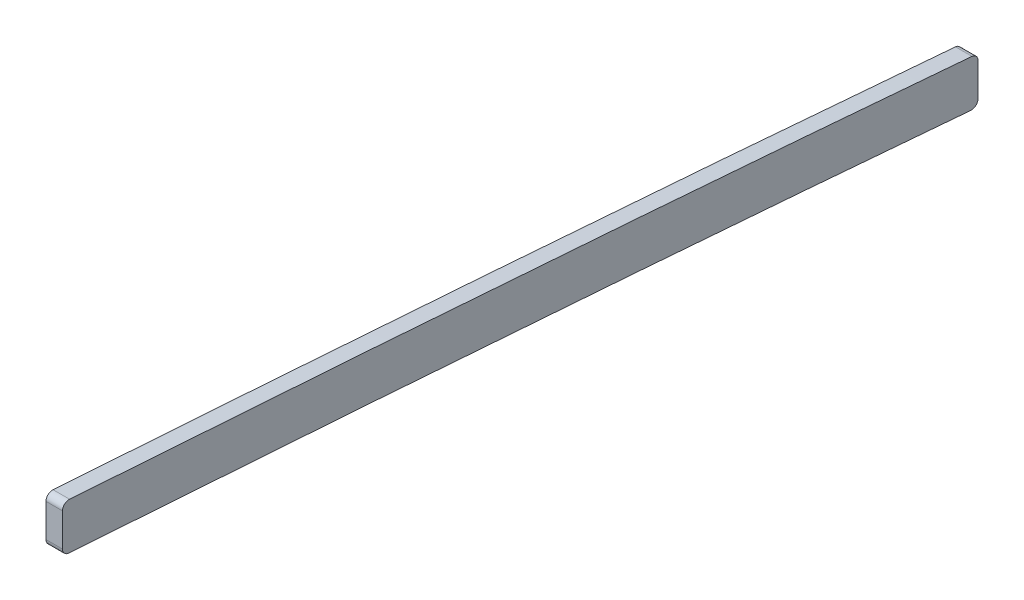
ISO-10303-21;
HEADER;
FILE_DESCRIPTION(('STEP AP214'),'2;1');
FILE_NAME('part.step','',(''),(''),'','','');
FILE_SCHEMA(('AUTOMOTIVE_DESIGN { 1 0 10303 214 1 1 1 1 }'));
ENDSEC;
DATA;
#1=APPLICATION_CONTEXT('core data for automotive mechanical design processes');
#2=APPLICATION_PROTOCOL_DEFINITION('international standard','automotive_design',2000,#1);
#3=PRODUCT_CONTEXT('',#1,'mechanical');
#4=PRODUCT('Part','Part','',(#3));
#5=PRODUCT_RELATED_PRODUCT_CATEGORY('part','',(#4));
#6=PRODUCT_DEFINITION_FORMATION('','',#4);
#7=PRODUCT_DEFINITION_CONTEXT('part definition',#1,'design');
#8=PRODUCT_DEFINITION('design','',#6,#7);
#9=PRODUCT_DEFINITION_SHAPE('','',#8);
#10=(LENGTH_UNIT() NAMED_UNIT(*) SI_UNIT(.MILLI.,.METRE.));
#11=(NAMED_UNIT(*) PLANE_ANGLE_UNIT() SI_UNIT($,.RADIAN.));
#12=(NAMED_UNIT(*) SI_UNIT($,.STERADIAN.) SOLID_ANGLE_UNIT());
#13=UNCERTAINTY_MEASURE_WITH_UNIT(LENGTH_MEASURE(1.E-05),#10,'distance_accuracy_value','');
#14=(GEOMETRIC_REPRESENTATION_CONTEXT(3) GLOBAL_UNCERTAINTY_ASSIGNED_CONTEXT((#13)) GLOBAL_UNIT_ASSIGNED_CONTEXT((#10,
#11,#12)) REPRESENTATION_CONTEXT('',''));
#15=CARTESIAN_POINT('',(0.,0.,0.));
#16=DIRECTION('',(0.,0.,1.));
#17=DIRECTION('',(1.,0.,0.));
#18=AXIS2_PLACEMENT_3D('',#15,#16,#17);
#19=CARTESIAN_POINT('',(1.5875,0.,0.));
#20=DIRECTION('',(1.,0.,0.));
#21=DIRECTION('',(0.,0.,-1.));
#22=AXIS2_PLACEMENT_3D('',#19,#20,#21);
#23=PLANE('',#22);
#24=CARTESIAN_POINT('',(1.5875,114.744712211049,-1735.36978708818));
#25=CARTESIAN_POINT('',(1.5875,110.735232017816,-1815.99594072318));
#26=CARTESIAN_POINT('',(1.5875,104.09636454831,-1936.9066504622));
#27=CARTESIAN_POINT('',(1.5875,94.1879787504419,-2098.04948516813));
#28=CARTESIAN_POINT('',(1.5875,87.3146385091305,-2198.69473672509));
#29=CARTESIAN_POINT('',(1.5875,81.1144189306114,-2279.13041374665));
#30=CARTESIAN_POINT('',(1.5875,76.0340766078011,-2339.41295030379));
#31=CARTESIAN_POINT('',(1.5875,70.2827054495217,-2399.56405433432));
#32=CARTESIAN_POINT('',(1.5875,61.1273782537238,-2479.57046826411));
#33=CARTESIAN_POINT('',(1.5875,49.6509076137669,-2559.29208787163));
#34=CARTESIAN_POINT('',(1.5875,38.2354847347183,-2626.79755458493));
#35=CARTESIAN_POINT('',(1.5875,32.3571302958871,-2659.27265183733));
#36=CARTESIAN_POINT('',(1.5875,28.6522110138429,-2679.06248770776));
#37=CARTESIAN_POINT('',(1.5875,26.3541994456866,-2690.94044026322));
#38=CARTESIAN_POINT('',(1.5875,24.9439248982718,-2698.06642332353));
#39=B_SPLINE_CURVE_WITH_KNOTS('',3,(#24,#25,#26,#27,#28,#29,#30,#31,#32,#33,#34,#35,#36,#37,
#38),.UNSPECIFIED.,.F.,.F.,(4,1,1,1,1,1,1,1,1,1,1,1,4),(0.,0.25,0.375,0.5,0.5625,0.625,0.6875,
0.75,0.875,0.9375,0.962410670199827,0.977446402119896,1.),.UNSPECIFIED.);
#40=CARTESIAN_POINT('',(1.5875,91.519678648898,-2136.37222712257));
#41=VERTEX_POINT('',#40);
#42=CARTESIAN_POINT('',(1.5875,78.4872851145334,-2310.02255532039));
#43=VERTEX_POINT('',#42);
#44=EDGE_CURVE('E115',#41,#43,#39,.T.);
#45=ORIENTED_EDGE('',*,*,#44,.T.);
#46=CARTESIAN_POINT('',(1.5875,79.752731929229,-2310.13));
#47=DIRECTION('',(1.,0.,0.));
#48=DIRECTION('',(0.,0.,-1.));
#49=AXIS2_PLACEMENT_3D('',#46,#47,#48);
#50=CIRCLE('',#49,1.27);
#51=CARTESIAN_POINT('',(1.5875,79.7527319292289,-2311.4));
#52=VERTEX_POINT('',#51);
#53=EDGE_CURVE('E247',#43,#52,#50,.T.);
#54=ORIENTED_EDGE('',*,*,#53,.T.);
#55=DIRECTION('',(0.,1.,0.));
#56=VECTOR('',#55,1.);
#57=CARTESIAN_POINT('',(1.5875,-1.15096295574831E-10,-2311.4));
#58=LINE('',#57,#56);
#59=CARTESIAN_POINT('',(1.5875,86.121800307132,-2311.4));
#60=VERTEX_POINT('',#59);
#61=EDGE_CURVE('E260',#52,#60,#58,.T.);
#62=ORIENTED_EDGE('',*,*,#61,.T.);
#63=CARTESIAN_POINT('',(1.5875,86.121800307132,-2310.13));
#64=DIRECTION('',(1.,0.,0.));
#65=DIRECTION('',(0.,0.,-1.));
#66=AXIS2_PLACEMENT_3D('',#63,#64,#65);
#67=CIRCLE('',#66,1.27);
#68=CARTESIAN_POINT('',(1.5875,87.3873581201983,-2310.23736802677));
#69=VERTEX_POINT('',#68);
#70=EDGE_CURVE('E168',#60,#69,#67,.T.);
#71=ORIENTED_EDGE('',*,*,#70,.T.);
#72=CARTESIAN_POINT('',(1.5875,100.417177393438,-2136.54276318493));
#73=CARTESIAN_POINT('',(1.5875,98.5571137716093,-2164.1860073924));
#74=CARTESIAN_POINT('',(1.5875,96.6188952190012,-2191.82395619038));
#75=CARTESIAN_POINT('',(1.5875,93.0801686873999,-2239.58699871448));
#76=CARTESIAN_POINT('',(1.5875,91.5298376215323,-2259.71628097743));
#77=CARTESIAN_POINT('',(1.5875,89.0908434299724,-2289.90044260235));
#78=CARTESIAN_POINT('',(1.5875,88.2588450388707,-2299.96017913521));
#79=CARTESIAN_POINT('',(1.5875,87.3996547943512,-2310.09118107085));
#80=CARTESIAN_POINT('',(1.5875,87.3934551380196,-2310.16427019507));
#81=CARTESIAN_POINT('',(1.5875,87.387254374734,-2310.23735922312));
#82=B_SPLINE_CURVE_WITH_KNOTS('',3,(#72,#73,#74,#75,#76,#77,#78,#79,#80,#81),.UNSPECIFIED.,.F.,
.F.,(4,2,2,2,4),(0.414227985667118,0.5,0.5625,0.59375,0.593977088680723),.UNSPECIFIED.);
#83=CARTESIAN_POINT('',(1.5875,100.41717746977,-2136.54276319007));
#84=VERTEX_POINT('',#83);
#85=EDGE_CURVE('E127',#84,#69,#82,.T.);
#86=ORIENTED_EDGE('',*,*,#85,.F.);
#87=CARTESIAN_POINT('',(1.5875,99.1500427560389,-2136.4575));
#88=DIRECTION('',(1.,0.,0.));
#89=DIRECTION('',(0.,0.,-1.));
#90=AXIS2_PLACEMENT_3D('',#87,#88,#89);
#91=CIRCLE('',#90,1.27);
#92=CARTESIAN_POINT('',(1.5875,99.1500427560389,-2135.1875));
#93=VERTEX_POINT('',#92);
#94=EDGE_CURVE('E160',#84,#93,#91,.T.);
#95=ORIENTED_EDGE('',*,*,#94,.T.);
#96=DIRECTION('',(0.,-1.,0.));
#97=VECTOR('',#96,1.);
#98=CARTESIAN_POINT('',(1.5875,0.,-2135.1875));
#99=LINE('',#98,#97);
#100=CARTESIAN_POINT('',(1.5875,92.7868126340687,-2135.1875));
#101=VERTEX_POINT('',#100);
#102=EDGE_CURVE('E155',#93,#101,#99,.T.);
#103=ORIENTED_EDGE('',*,*,#102,.T.);
#104=CARTESIAN_POINT('',(1.5875,92.7868126340687,-2136.4575));
#105=DIRECTION('',(1.,0.,0.));
#106=DIRECTION('',(0.,0.,-1.));
#107=AXIS2_PLACEMENT_3D('',#104,#105,#106);
#108=CIRCLE('',#107,1.27);
#109=EDGE_CURVE('E253',#101,#41,#108,.T.);
#110=ORIENTED_EDGE('',*,*,#109,.T.);
#111=EDGE_LOOP('',(#45,#54,#62,#71,#86,#95,#103,#110));
#112=FACE_BOUND('',#111,.T.);
#113=ADVANCED_FACE('F40',(#112),#23,.T.);
#114=CARTESIAN_POINT('',(-1.5875,0.,0.));
#115=DIRECTION('',(1.,0.,0.));
#116=DIRECTION('',(0.,0.,-1.));
#117=AXIS2_PLACEMENT_3D('',#114,#115,#116);
#118=PLANE('',#117);
#119=DIRECTION('',(0.,1.,0.));
#120=VECTOR('',#119,1.);
#121=CARTESIAN_POINT('',(-1.5875,-1.15096295574831E-10,-2311.4));
#122=LINE('',#121,#120);
#123=CARTESIAN_POINT('',(-1.5875,79.7527319292289,-2311.4));
#124=VERTEX_POINT('',#123);
#125=CARTESIAN_POINT('',(-1.5875,86.121800307132,-2311.4));
#126=VERTEX_POINT('',#125);
#127=EDGE_CURVE('E157',#124,#126,#122,.T.);
#128=ORIENTED_EDGE('',*,*,#127,.F.);
#129=CARTESIAN_POINT('',(-1.5875,79.752731929229,-2310.13));
#130=DIRECTION('',(1.,0.,0.));
#131=DIRECTION('',(0.,0.,-1.));
#132=AXIS2_PLACEMENT_3D('',#129,#130,#131);
#133=CIRCLE('',#132,1.27);
#134=CARTESIAN_POINT('',(-1.5875,78.4872851145334,-2310.02255532039));
#135=VERTEX_POINT('',#134);
#136=EDGE_CURVE('E126',#124,#135,#133,.F.);
#137=ORIENTED_EDGE('',*,*,#136,.T.);
#138=CARTESIAN_POINT('',(-1.5875,114.744712211049,-1735.36978708818));
#139=CARTESIAN_POINT('',(-1.5875,110.735232017816,-1815.99594072318));
#140=CARTESIAN_POINT('',(-1.5875,104.09636454831,-1936.9066504622));
#141=CARTESIAN_POINT('',(-1.5875,94.1879787504419,-2098.04948516813));
#142=CARTESIAN_POINT('',(-1.5875,87.3146385091305,-2198.69473672509));
#143=CARTESIAN_POINT('',(-1.5875,81.1144189306114,-2279.13041374665));
#144=CARTESIAN_POINT('',(-1.5875,76.0340766078011,-2339.41295030379));
#145=CARTESIAN_POINT('',(-1.5875,70.2827054495217,-2399.56405433432));
#146=CARTESIAN_POINT('',(-1.5875,61.1273782537238,-2479.57046826411));
#147=CARTESIAN_POINT('',(-1.5875,49.6509076137669,-2559.29208787163));
#148=CARTESIAN_POINT('',(-1.5875,38.2354847347183,-2626.79755458493));
#149=CARTESIAN_POINT('',(-1.5875,32.3571302958871,-2659.27265183733));
#150=CARTESIAN_POINT('',(-1.5875,28.6522110138429,-2679.06248770776));
#151=CARTESIAN_POINT('',(-1.5875,26.3541994456866,-2690.94044026322));
#152=CARTESIAN_POINT('',(-1.5875,24.9439248982718,-2698.06642332353));
#153=B_SPLINE_CURVE_WITH_KNOTS('',3,(#138,#139,#140,#141,#142,#143,#144,#145,#146,#147,#148,
#149,#150,#151,#152),.UNSPECIFIED.,.F.,.F.,(4,1,1,1,1,1,1,1,1,1,1,1,4),(0.,0.25,0.375,0.5,
0.5625,0.625,0.6875,0.75,0.875,0.9375,0.962410670199827,0.977446402119896,1.),.UNSPECIFIED.);
#154=CARTESIAN_POINT('',(-1.5875,91.519678648898,-2136.37222712257));
#155=VERTEX_POINT('',#154);
#156=EDGE_CURVE('E112',#155,#135,#153,.T.);
#157=ORIENTED_EDGE('',*,*,#156,.F.);
#158=CARTESIAN_POINT('',(-1.5875,92.7868126340687,-2136.4575));
#159=DIRECTION('',(1.,0.,0.));
#160=DIRECTION('',(0.,0.,-1.));
#161=AXIS2_PLACEMENT_3D('',#158,#159,#160);
#162=CIRCLE('',#161,1.27);
#163=CARTESIAN_POINT('',(-1.5875,92.7868126340687,-2135.1875));
#164=VERTEX_POINT('',#163);
#165=EDGE_CURVE('E123',#155,#164,#162,.F.);
#166=ORIENTED_EDGE('',*,*,#165,.T.);
#167=DIRECTION('',(0.,-1.,0.));
#168=VECTOR('',#167,1.);
#169=CARTESIAN_POINT('',(-1.5875,0.,-2135.1875));
#170=LINE('',#169,#168);
#171=CARTESIAN_POINT('',(-1.5875,99.1500427560389,-2135.1875));
#172=VERTEX_POINT('',#171);
#173=EDGE_CURVE('E119',#172,#164,#170,.T.);
#174=ORIENTED_EDGE('',*,*,#173,.F.);
#175=CARTESIAN_POINT('',(-1.5875,99.1500427560389,-2136.4575));
#176=DIRECTION('',(1.,0.,0.));
#177=DIRECTION('',(0.,0.,-1.));
#178=AXIS2_PLACEMENT_3D('',#175,#176,#177);
#179=CIRCLE('',#178,1.27);
#180=CARTESIAN_POINT('',(-1.5875,100.417176047924,-2136.54276309439));
#181=VERTEX_POINT('',#180);
#182=EDGE_CURVE('E62',#172,#181,#179,.F.);
#183=ORIENTED_EDGE('',*,*,#182,.T.);
#184=CARTESIAN_POINT('',(-1.5875,87.387254374394,-2310.23735922713));
#185=CARTESIAN_POINT('',(-1.5875,87.3934551377931,-2310.16427019774));
#186=CARTESIAN_POINT('',(-1.5875,87.399654794238,-2310.09118107218));
#187=CARTESIAN_POINT('',(-1.5875,88.2588450388707,-2299.96017913521));
#188=CARTESIAN_POINT('',(-1.5875,89.0908434299724,-2289.90044260235));
#189=CARTESIAN_POINT('',(-1.5875,91.5298376215323,-2259.71628097743));
#190=CARTESIAN_POINT('',(-1.5875,93.0801686873999,-2239.58699871448));
#191=CARTESIAN_POINT('',(-1.5875,96.6188952190014,-2191.82395619037));
#192=CARTESIAN_POINT('',(-1.5875,98.5571137716097,-2164.18600739239));
#193=CARTESIAN_POINT('',(-1.5875,100.417177393438,-2136.54276318492));
#194=B_SPLINE_CURVE_WITH_KNOTS('',3,(#184,#185,#186,#187,#188,#189,#190,#191,#192,#193),
.UNSPECIFIED.,.F.,.F.,(4,2,2,2,4),(0.414227985667109,0.414455074351982,0.445705074351982,
0.508205074351982,0.593977088684873),.UNSPECIFIED.);
#195=CARTESIAN_POINT('',(-1.5875,87.3873576545853,-2310.23736798927));
#196=VERTEX_POINT('',#195);
#197=EDGE_CURVE('E128',#181,#196,#194,.F.);
#198=ORIENTED_EDGE('',*,*,#197,.T.);
#199=CARTESIAN_POINT('',(-1.5875,86.121800307132,-2310.13));
#200=DIRECTION('',(1.,0.,0.));
#201=DIRECTION('',(0.,0.,-1.));
#202=AXIS2_PLACEMENT_3D('',#199,#200,#201);
#203=CIRCLE('',#202,1.27);
#204=EDGE_CURVE('E132',#196,#126,#203,.F.);
#205=ORIENTED_EDGE('',*,*,#204,.T.);
#206=EDGE_LOOP('',(#128,#137,#157,#166,#174,#183,#198,#205));
#207=FACE_BOUND('',#206,.T.);
#208=ADVANCED_FACE('F122',(#207),#118,.F.);
#209=DIRECTION('',(1.,0.,0.));
#210=VECTOR('',#209,1.);
#211=SURFACE_OF_LINEAR_EXTRUSION('',#153,#210);
#212=ORIENTED_EDGE('',*,*,#156,.T.);
#213=DIRECTION('',(1.,0.,0.));
#214=VECTOR('',#213,1.);
#215=CARTESIAN_POINT('',(-1.5875,78.4872851145334,-2310.02255532039));
#216=LINE('',#215,#214);
#217=EDGE_CURVE('E118',#135,#43,#216,.T.);
#218=ORIENTED_EDGE('',*,*,#217,.T.);
#219=ORIENTED_EDGE('',*,*,#44,.F.);
#220=DIRECTION('',(1.,0.,0.));
#221=VECTOR('',#220,1.);
#222=CARTESIAN_POINT('',(1.5875,91.519678648898,-2136.37222712257));
#223=LINE('',#222,#221);
#224=EDGE_CURVE('E108',#41,#155,#223,.F.);
#225=ORIENTED_EDGE('',*,*,#224,.T.);
#226=EDGE_LOOP('',(#212,#218,#219,#225));
#227=FACE_BOUND('',#226,.T.);
#228=ADVANCED_FACE('F110',(#227),#211,.T.);
#229=CARTESIAN_POINT('',(-1.5875,123.62374006878,-1735.81133470922));
#230=CARTESIAN_POINT('',(-1.5875,121.618292624347,-1776.13863549866));
#231=CARTESIAN_POINT('',(-1.5875,119.500621805793,-1816.46028157928));
#232=CARTESIAN_POINT('',(-1.5875,115.087561884835,-1897.09366867468));
#233=CARTESIAN_POINT('',(-1.5875,112.792971084113,-1937.4056388964));
#234=CARTESIAN_POINT('',(-1.5875,108.01836652323,-2018.0184190449));
#235=CARTESIAN_POINT('',(-1.5875,105.539122976217,-2058.31951222306));
#236=CARTESIAN_POINT('',(-1.5875,100.307240032155,-2138.90378014414));
#237=CARTESIAN_POINT('',(-1.5875,97.5551279550714,-2179.18739792965));
#238=CARTESIAN_POINT('',(-1.5875,93.0801686873999,-2239.58699871448));
#239=CARTESIAN_POINT('',(-1.5875,91.5298376215323,-2259.71628097743));
#240=CARTESIAN_POINT('',(-1.5875,89.0908434299724,-2289.90044260235));
#241=CARTESIAN_POINT('',(-1.5875,88.2588450388707,-2299.96017913521));
#242=CARTESIAN_POINT('',(-1.5875,86.5528616543479,-2320.0760045662));
#243=CARTESIAN_POINT('',(-1.5875,85.6789622226699,-2330.13210089761));
#244=CARTESIAN_POINT('',(-1.5875,83.8743348466212,-2350.23935651754));
#245=CARTESIAN_POINT('',(-1.5875,82.9433074844211,-2360.29048979378));
#246=CARTESIAN_POINT('',(-1.5875,81.0031832968026,-2380.3859739712));
#247=CARTESIAN_POINT('',(-1.5875,79.9934185550902,-2390.43006537759));
#248=CARTESIAN_POINT('',(-1.5875,76.8275775323524,-2420.5470261948));
#249=CARTESIAN_POINT('',(-1.5875,74.5336729547823,-2440.6064858901));
#250=CARTESIAN_POINT('',(-1.5875,69.5562785225382,-2480.67556956821));
#251=CARTESIAN_POINT('',(-1.5875,66.8741508113434,-2500.6871518296));
#252=CARTESIAN_POINT('',(-1.5875,61.1502462952664,-2540.65429020717));
#253=CARTESIAN_POINT('',(-1.5875,58.1097556460363,-2560.61102642776));
#254=CARTESIAN_POINT('',(-1.5875,51.7024655740435,-2600.47545713133));
#255=CARTESIAN_POINT('',(-1.5875,48.3375388880153,-2620.38296708947));
#256=CARTESIAN_POINT('',(-1.5875,43.0416957000558,-2650.1996164959));
#257=CARTESIAN_POINT('',(-1.5875,41.2345222277721,-2660.13118962649));
#258=CARTESIAN_POINT('',(-1.5875,37.5258634945269,-2679.97612471736));
#259=CARTESIAN_POINT('',(-1.5875,35.6245635215631,-2689.88973979233));
#260=CARTESIAN_POINT('',(-1.5875,33.6647813022258,-2699.79233281757));
#261=B_SPLINE_CURVE_WITH_KNOTS('',3,(#229,#230,#231,#232,#233,#234,#235,#236,#237,#238,#239,
#240,#241,#242,#243,#244,#245,#246,#247,#248,#249,#250,#251,#252,#253,#254,#255,#256,#257,#258,
#259,#260),.UNSPECIFIED.,.F.,.F.,(4,2,2,2,2,2,2,2,2,2,2,2,2,2,2,4),(0.,0.125,0.25,0.375,0.5,
0.5625,0.59375,0.625,0.65625,0.6875,0.75,0.8125,0.875,0.9375,0.96875,1.),.UNSPECIFIED.);
#262=DIRECTION('',(1.,0.,0.));
#263=VECTOR('',#262,1.);
#264=SURFACE_OF_LINEAR_EXTRUSION('',#261,#263);
#265=ORIENTED_EDGE('',*,*,#85,.T.);
#266=DIRECTION('',(1.,0.,0.));
#267=VECTOR('',#266,1.);
#268=CARTESIAN_POINT('',(1.5875,87.3872543749054,-2310.2373592211));
#269=LINE('',#268,#267);
#270=EDGE_CURVE('E55',#69,#196,#269,.F.);
#271=ORIENTED_EDGE('',*,*,#270,.T.);
#272=ORIENTED_EDGE('',*,*,#197,.F.);
#273=DIRECTION('',(1.,0.,0.));
#274=VECTOR('',#273,1.);
#275=CARTESIAN_POINT('',(-1.5875,100.417177393438,-2136.54276318493));
#276=LINE('',#275,#274);
#277=EDGE_CURVE('E143',#181,#84,#276,.T.);
#278=ORIENTED_EDGE('',*,*,#277,.T.);
#279=EDGE_LOOP('',(#265,#271,#272,#278));
#280=FACE_BOUND('',#279,.T.);
#281=ADVANCED_FACE('F162',(#280),#264,.F.);
#282=CARTESIAN_POINT('',(-1.59250269714593,-1.15096295574831E-10,-2311.4));
#283=DIRECTION('',(0.,0.,-1.));
#284=DIRECTION('',(0.,1.,0.));
#285=AXIS2_PLACEMENT_3D('',#282,#283,#284);
#286=PLANE('',#285);
#287=ORIENTED_EDGE('',*,*,#61,.F.);
#288=DIRECTION('',(1.,0.,0.));
#289=VECTOR('',#288,1.);
#290=CARTESIAN_POINT('',(-1.59250269714593,79.7527319292289,-2311.4));
#291=LINE('',#290,#289);
#292=EDGE_CURVE('E135',#52,#124,#291,.F.);
#293=ORIENTED_EDGE('',*,*,#292,.T.);
#294=ORIENTED_EDGE('',*,*,#127,.T.);
#295=DIRECTION('',(-1.,0.,0.));
#296=VECTOR('',#295,1.);
#297=CARTESIAN_POINT('',(1.5875,86.121800307132,-2311.4));
#298=LINE('',#297,#296);
#299=EDGE_CURVE('E249',#126,#60,#298,.F.);
#300=ORIENTED_EDGE('',*,*,#299,.T.);
#301=EDGE_LOOP('',(#287,#293,#294,#300));
#302=FACE_BOUND('',#301,.T.);
#303=ADVANCED_FACE('F195',(#302),#286,.T.);
#304=CARTESIAN_POINT('',(-1.59250269714593,0.,-2135.1875));
#305=DIRECTION('',(0.,0.,1.));
#306=DIRECTION('',(1.,0.,0.));
#307=AXIS2_PLACEMENT_3D('',#304,#305,#306);
#308=PLANE('',#307);
#309=ORIENTED_EDGE('',*,*,#173,.T.);
#310=DIRECTION('',(1.,0.,0.));
#311=VECTOR('',#310,1.);
#312=CARTESIAN_POINT('',(-1.59250269714593,92.7868126340687,-2135.1875));
#313=LINE('',#312,#311);
#314=EDGE_CURVE('E11',#164,#101,#313,.T.);
#315=ORIENTED_EDGE('',*,*,#314,.T.);
#316=ORIENTED_EDGE('',*,*,#102,.F.);
#317=DIRECTION('',(-1.,0.,0.));
#318=VECTOR('',#317,1.);
#319=CARTESIAN_POINT('',(-1.59250269714593,99.1500427560389,-2135.1875));
#320=LINE('',#319,#318);
#321=EDGE_CURVE('E48',#93,#172,#320,.T.);
#322=ORIENTED_EDGE('',*,*,#321,.T.);
#323=EDGE_LOOP('',(#309,#315,#316,#322));
#324=FACE_BOUND('',#323,.T.);
#325=ADVANCED_FACE('F153',(#324),#308,.T.);
#326=CARTESIAN_POINT('',(0.,79.752731929229,-2310.13));
#327=DIRECTION('',(1.,0.,0.));
#328=DIRECTION('',(0.,0.,-1.));
#329=AXIS2_PLACEMENT_3D('',#326,#327,#328);
#330=CYLINDRICAL_SURFACE('',#329,1.27);
#331=ORIENTED_EDGE('',*,*,#136,.F.);
#332=ORIENTED_EDGE('',*,*,#292,.F.);
#333=ORIENTED_EDGE('',*,*,#53,.F.);
#334=ORIENTED_EDGE('',*,*,#217,.F.);
#335=EDGE_LOOP('',(#331,#332,#333,#334));
#336=FACE_BOUND('',#335,.T.);
#337=ADVANCED_FACE('F201',(#336),#330,.T.);
#338=CARTESIAN_POINT('',(-0.00250134857296565,86.121800307132,-2310.13));
#339=DIRECTION('',(1.,0.,0.));
#340=DIRECTION('',(0.,0.,-1.));
#341=AXIS2_PLACEMENT_3D('',#338,#339,#340);
#342=CYLINDRICAL_SURFACE('',#341,1.27);
#343=ORIENTED_EDGE('',*,*,#204,.F.);
#344=ORIENTED_EDGE('',*,*,#270,.F.);
#345=ORIENTED_EDGE('',*,*,#70,.F.);
#346=ORIENTED_EDGE('',*,*,#299,.F.);
#347=EDGE_LOOP('',(#343,#344,#345,#346));
#348=FACE_BOUND('',#347,.T.);
#349=ADVANCED_FACE('F270',(#348),#342,.T.);
#350=CARTESIAN_POINT('',(0.,92.7868126340687,-2136.4575));
#351=DIRECTION('',(1.,0.,0.));
#352=DIRECTION('',(0.,0.,-1.));
#353=AXIS2_PLACEMENT_3D('',#350,#351,#352);
#354=CYLINDRICAL_SURFACE('',#353,1.27);
#355=ORIENTED_EDGE('',*,*,#165,.F.);
#356=ORIENTED_EDGE('',*,*,#224,.F.);
#357=ORIENTED_EDGE('',*,*,#109,.F.);
#358=ORIENTED_EDGE('',*,*,#314,.F.);
#359=EDGE_LOOP('',(#355,#356,#357,#358));
#360=FACE_BOUND('',#359,.T.);
#361=ADVANCED_FACE('F131',(#360),#354,.T.);
#362=CARTESIAN_POINT('',(-0.00250134857296565,99.1500427560389,-2136.4575));
#363=DIRECTION('',(1.,0.,0.));
#364=DIRECTION('',(0.,0.,-1.));
#365=AXIS2_PLACEMENT_3D('',#362,#363,#364);
#366=CYLINDRICAL_SURFACE('',#365,1.27);
#367=ORIENTED_EDGE('',*,*,#182,.F.);
#368=ORIENTED_EDGE('',*,*,#321,.F.);
#369=ORIENTED_EDGE('',*,*,#94,.F.);
#370=ORIENTED_EDGE('',*,*,#277,.F.);
#371=EDGE_LOOP('',(#367,#368,#369,#370));
#372=FACE_BOUND('',#371,.T.);
#373=ADVANCED_FACE('F42',(#372),#366,.T.);
#374=CLOSED_SHELL('',(#113,#208,#228,#281,#303,#325,#337,#349,#361,#373));
#375=MANIFOLD_SOLID_BREP('B2',#374);
#376=ADVANCED_BREP_SHAPE_REPRESENTATION('',(#18,#375),#14);
#377=SHAPE_DEFINITION_REPRESENTATION(#9,#376);
ENDSEC;
END-ISO-10303-21;
